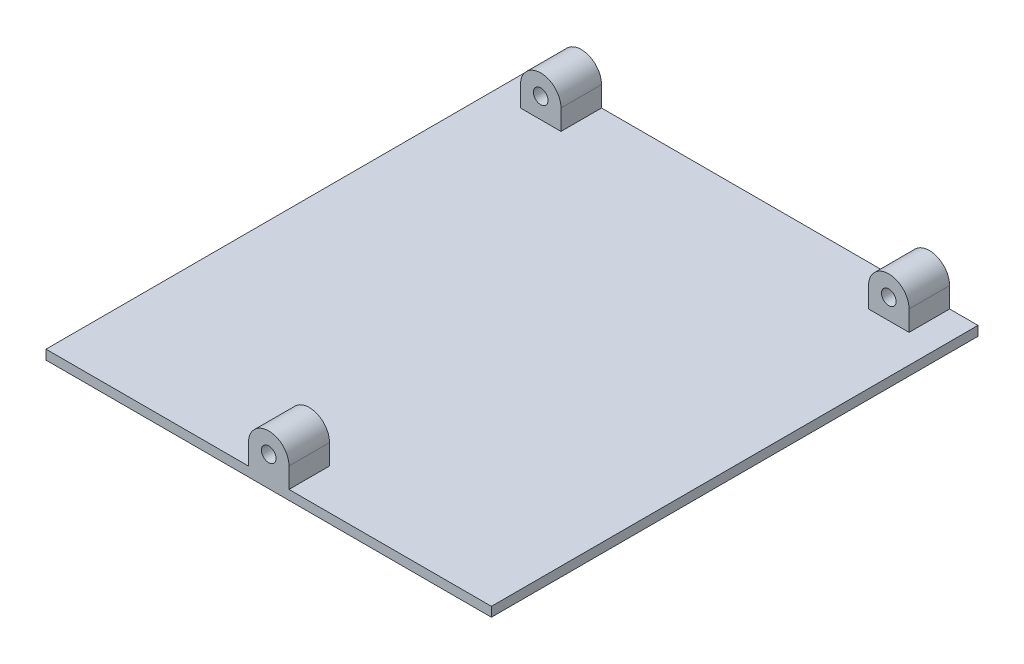
ISO-10303-21;
HEADER;
FILE_DESCRIPTION(('STEP AP214'),'2;1');
FILE_NAME('part.step','',(''),(''),'','','');
FILE_SCHEMA(('AUTOMOTIVE_DESIGN { 1 0 10303 214 1 1 1 1 }'));
ENDSEC;
DATA;
#1=APPLICATION_CONTEXT('core data for automotive mechanical design processes');
#2=APPLICATION_PROTOCOL_DEFINITION('international standard','automotive_design',2000,#1);
#3=PRODUCT_CONTEXT('',#1,'mechanical');
#4=PRODUCT('Part','Part','',(#3));
#5=PRODUCT_RELATED_PRODUCT_CATEGORY('part','',(#4));
#6=PRODUCT_DEFINITION_FORMATION('','',#4);
#7=PRODUCT_DEFINITION_CONTEXT('part definition',#1,'design');
#8=PRODUCT_DEFINITION('design','',#6,#7);
#9=PRODUCT_DEFINITION_SHAPE('','',#8);
#10=(LENGTH_UNIT() NAMED_UNIT(*) SI_UNIT(.MILLI.,.METRE.));
#11=(NAMED_UNIT(*) PLANE_ANGLE_UNIT() SI_UNIT($,.RADIAN.));
#12=(NAMED_UNIT(*) SI_UNIT($,.STERADIAN.) SOLID_ANGLE_UNIT());
#13=UNCERTAINTY_MEASURE_WITH_UNIT(LENGTH_MEASURE(1.E-05),#10,'distance_accuracy_value','');
#14=(GEOMETRIC_REPRESENTATION_CONTEXT(3) GLOBAL_UNCERTAINTY_ASSIGNED_CONTEXT((#13)) GLOBAL_UNIT_ASSIGNED_CONTEXT((#10,
#11,#12)) REPRESENTATION_CONTEXT('',''));
#15=CARTESIAN_POINT('',(0.,0.,0.));
#16=DIRECTION('',(0.,0.,1.));
#17=DIRECTION('',(1.,0.,0.));
#18=AXIS2_PLACEMENT_3D('',#15,#16,#17);
#19=CARTESIAN_POINT('',(0.,6.35,0.));
#20=DIRECTION('',(1.,0.,0.));
#21=DIRECTION('',(0.,0.,-1.));
#22=AXIS2_PLACEMENT_3D('',#19,#20,#21);
#23=PLANE('',#22);
#24=DIRECTION('',(0.,0.,1.));
#25=VECTOR('',#24,1.);
#26=CARTESIAN_POINT('',(0.,2.975,-152.4));
#27=LINE('',#26,#25);
#28=CARTESIAN_POINT('',(0.,2.975,-152.4));
#29=VERTEX_POINT('',#28);
#30=CARTESIAN_POINT('',(0.,2.975,0.));
#31=VERTEX_POINT('',#30);
#32=EDGE_CURVE('E252',#29,#31,#27,.T.);
#33=ORIENTED_EDGE('',*,*,#32,.F.);
#34=DIRECTION('',(0.,-1.,0.));
#35=VECTOR('',#34,1.);
#36=CARTESIAN_POINT('',(0.,6.35,-152.4));
#37=LINE('',#36,#35);
#38=CARTESIAN_POINT('',(0.,0.,-152.4));
#39=VERTEX_POINT('',#38);
#40=EDGE_CURVE('E282',#29,#39,#37,.T.);
#41=ORIENTED_EDGE('',*,*,#40,.T.);
#42=DIRECTION('',(0.,0.,1.));
#43=VECTOR('',#42,1.);
#44=CARTESIAN_POINT('',(0.,0.,0.));
#45=LINE('',#44,#43);
#46=CARTESIAN_POINT('',(0.,0.,0.));
#47=VERTEX_POINT('',#46);
#48=EDGE_CURVE('E269',#39,#47,#45,.T.);
#49=ORIENTED_EDGE('',*,*,#48,.T.);
#50=DIRECTION('',(0.,-1.,0.));
#51=VECTOR('',#50,1.);
#52=CARTESIAN_POINT('',(0.,6.35,0.));
#53=LINE('',#52,#51);
#54=EDGE_CURVE('E11',#31,#47,#53,.T.);
#55=ORIENTED_EDGE('',*,*,#54,.F.);
#56=EDGE_LOOP('',(#33,#41,#49,#55));
#57=FACE_BOUND('',#56,.T.);
#58=ADVANCED_FACE('F37',(#57),#23,.F.);
#59=CARTESIAN_POINT('',(0.,6.35,0.));
#60=DIRECTION('',(0.,0.,-1.));
#61=DIRECTION('',(-1.,0.,0.));
#62=AXIS2_PLACEMENT_3D('',#59,#60,#61);
#63=PLANE('',#62);
#64=DIRECTION('',(1.,0.,0.));
#65=VECTOR('',#64,1.);
#66=CARTESIAN_POINT('',(0.,2.975,0.));
#67=LINE('',#66,#65);
#68=CARTESIAN_POINT('',(63.4,2.975,0.));
#69=VERTEX_POINT('',#68);
#70=EDGE_CURVE('E261',#31,#69,#67,.T.);
#71=ORIENTED_EDGE('',*,*,#70,.F.);
#72=ORIENTED_EDGE('',*,*,#54,.T.);
#73=DIRECTION('',(1.,0.,0.));
#74=VECTOR('',#73,1.);
#75=CARTESIAN_POINT('',(0.,0.,0.));
#76=LINE('',#75,#74);
#77=CARTESIAN_POINT('',(139.5,0.,0.));
#78=VERTEX_POINT('',#77);
#79=EDGE_CURVE('E273',#47,#78,#76,.T.);
#80=ORIENTED_EDGE('',*,*,#79,.T.);
#81=DIRECTION('',(0.,-1.,0.));
#82=VECTOR('',#81,1.);
#83=CARTESIAN_POINT('',(139.5,6.35,0.));
#84=LINE('',#83,#82);
#85=CARTESIAN_POINT('',(139.5,2.975,0.));
#86=VERTEX_POINT('',#85);
#87=EDGE_CURVE('E44',#86,#78,#84,.T.);
#88=ORIENTED_EDGE('',*,*,#87,.F.);
#89=CARTESIAN_POINT('',(76.1,2.975,0.));
#90=VERTEX_POINT('',#89);
#91=EDGE_CURVE('E260',#90,#86,#67,.T.);
#92=ORIENTED_EDGE('',*,*,#91,.F.);
#93=DIRECTION('',(0.,1.,0.));
#94=VECTOR('',#93,1.);
#95=CARTESIAN_POINT('',(76.1,9.32500015835304,0.));
#96=LINE('',#95,#94);
#97=CARTESIAN_POINT('',(76.1,9.32500015835304,0.));
#98=VERTEX_POINT('',#97);
#99=EDGE_CURVE('E233',#90,#98,#96,.T.);
#100=ORIENTED_EDGE('',*,*,#99,.T.);
#101=CARTESIAN_POINT('',(69.75,9.32500015835304,0.));
#102=DIRECTION('',(0.,0.,1.));
#103=DIRECTION('',(1.,0.,0.));
#104=AXIS2_PLACEMENT_3D('',#101,#102,#103);
#105=CIRCLE('',#104,6.35);
#106=CARTESIAN_POINT('',(63.4,9.325,0.));
#107=VERTEX_POINT('',#106);
#108=EDGE_CURVE('E226',#98,#107,#105,.T.);
#109=ORIENTED_EDGE('',*,*,#108,.T.);
#110=DIRECTION('',(0.,-1.,0.));
#111=VECTOR('',#110,1.);
#112=CARTESIAN_POINT('',(63.4,9.325,0.));
#113=LINE('',#112,#111);
#114=EDGE_CURVE('E245',#107,#69,#113,.T.);
#115=ORIENTED_EDGE('',*,*,#114,.T.);
#116=EDGE_LOOP('',(#71,#72,#80,#88,#92,#100,#109,#115));
#117=FACE_BOUND('',#116,.T.);
#118=CARTESIAN_POINT('',(69.75,9.32500015835304,0.));
#119=DIRECTION('',(0.,0.,1.));
#120=DIRECTION('',(1.,0.,0.));
#121=AXIS2_PLACEMENT_3D('',#118,#119,#120);
#122=CIRCLE('',#121,2.28599999999999);
#123=CARTESIAN_POINT('',(72.036,9.32500015835304,0.));
#124=VERTEX_POINT('',#123);
#125=EDGE_CURVE('E215',#124,#124,#122,.T.);
#126=ORIENTED_EDGE('',*,*,#125,.F.);
#127=EDGE_LOOP('',(#126));
#128=FACE_BOUND('',#127,.T.);
#129=ADVANCED_FACE('F296',(#117,#128),#63,.F.);
#130=CARTESIAN_POINT('',(139.5,6.35,0.));
#131=DIRECTION('',(-1.,0.,0.));
#132=DIRECTION('',(0.,0.,1.));
#133=AXIS2_PLACEMENT_3D('',#130,#131,#132);
#134=PLANE('',#133);
#135=DIRECTION('',(0.,0.,-1.));
#136=VECTOR('',#135,1.);
#137=CARTESIAN_POINT('',(139.5,2.975,-152.4));
#138=LINE('',#137,#136);
#139=CARTESIAN_POINT('',(139.5,2.975,-152.4));
#140=VERTEX_POINT('',#139);
#141=EDGE_CURVE('E264',#86,#140,#138,.T.);
#142=ORIENTED_EDGE('',*,*,#141,.F.);
#143=ORIENTED_EDGE('',*,*,#87,.T.);
#144=DIRECTION('',(0.,0.,-1.));
#145=VECTOR('',#144,1.);
#146=CARTESIAN_POINT('',(139.5,0.,0.));
#147=LINE('',#146,#145);
#148=CARTESIAN_POINT('',(139.5,0.,-152.4));
#149=VERTEX_POINT('',#148);
#150=EDGE_CURVE('E276',#78,#149,#147,.T.);
#151=ORIENTED_EDGE('',*,*,#150,.T.);
#152=DIRECTION('',(0.,-1.,0.));
#153=VECTOR('',#152,1.);
#154=CARTESIAN_POINT('',(139.5,6.35,-152.4));
#155=LINE('',#154,#153);
#156=EDGE_CURVE('E284',#140,#149,#155,.T.);
#157=ORIENTED_EDGE('',*,*,#156,.F.);
#158=EDGE_LOOP('',(#142,#143,#151,#157));
#159=FACE_BOUND('',#158,.T.);
#160=ADVANCED_FACE('F288',(#159),#134,.F.);
#161=CARTESIAN_POINT('',(0.,6.35,-152.4));
#162=DIRECTION('',(0.,0.,1.));
#163=DIRECTION('',(1.,0.,0.));
#164=AXIS2_PLACEMENT_3D('',#161,#162,#163);
#165=PLANE('',#164);
#166=DIRECTION('',(-1.,0.,0.));
#167=VECTOR('',#166,1.);
#168=CARTESIAN_POINT('',(0.,2.975,-152.4));
#169=LINE('',#168,#167);
#170=CARTESIAN_POINT('',(130.61,2.975,-152.4));
#171=VERTEX_POINT('',#170);
#172=EDGE_CURVE('E267',#140,#171,#169,.T.);
#173=ORIENTED_EDGE('',*,*,#172,.F.);
#174=ORIENTED_EDGE('',*,*,#156,.T.);
#175=DIRECTION('',(-1.,0.,0.));
#176=VECTOR('',#175,1.);
#177=CARTESIAN_POINT('',(0.,0.,-152.4));
#178=LINE('',#177,#176);
#179=EDGE_CURVE('E279',#149,#39,#178,.T.);
#180=ORIENTED_EDGE('',*,*,#179,.T.);
#181=ORIENTED_EDGE('',*,*,#40,.F.);
#182=CARTESIAN_POINT('',(8.89,2.975,-152.4));
#183=VERTEX_POINT('',#182);
#184=EDGE_CURVE('E266',#183,#29,#169,.T.);
#185=ORIENTED_EDGE('',*,*,#184,.F.);
#186=DIRECTION('',(0.,1.,0.));
#187=VECTOR('',#186,1.);
#188=CARTESIAN_POINT('',(8.89,9.325,-152.4));
#189=LINE('',#188,#187);
#190=CARTESIAN_POINT('',(8.89,9.325,-152.4));
#191=VERTEX_POINT('',#190);
#192=EDGE_CURVE('E168',#183,#191,#189,.T.);
#193=ORIENTED_EDGE('',*,*,#192,.T.);
#194=CARTESIAN_POINT('',(15.24,9.325,-152.4));
#195=DIRECTION('',(0.,0.,-1.));
#196=DIRECTION('',(-1.,0.,0.));
#197=AXIS2_PLACEMENT_3D('',#194,#195,#196);
#198=CIRCLE('',#197,6.35);
#199=CARTESIAN_POINT('',(21.59,9.325,-152.4));
#200=VERTEX_POINT('',#199);
#201=EDGE_CURVE('E178',#191,#200,#198,.T.);
#202=ORIENTED_EDGE('',*,*,#201,.T.);
#203=DIRECTION('',(0.,-1.,0.));
#204=VECTOR('',#203,1.);
#205=CARTESIAN_POINT('',(21.59,9.325,-152.4));
#206=LINE('',#205,#204);
#207=CARTESIAN_POINT('',(21.59,2.975,-152.4));
#208=VERTEX_POINT('',#207);
#209=EDGE_CURVE('E152',#200,#208,#206,.T.);
#210=ORIENTED_EDGE('',*,*,#209,.T.);
#211=CARTESIAN_POINT('',(117.91,2.975,-152.4));
#212=VERTEX_POINT('',#211);
#213=EDGE_CURVE('E270',#212,#208,#169,.T.);
#214=ORIENTED_EDGE('',*,*,#213,.F.);
#215=DIRECTION('',(0.,1.,0.));
#216=VECTOR('',#215,1.);
#217=CARTESIAN_POINT('',(117.91,9.325,-152.4));
#218=LINE('',#217,#216);
#219=CARTESIAN_POINT('',(117.91,9.325,-152.4));
#220=VERTEX_POINT('',#219);
#221=EDGE_CURVE('E197',#212,#220,#218,.T.);
#222=ORIENTED_EDGE('',*,*,#221,.T.);
#223=CARTESIAN_POINT('',(124.26,9.325,-152.4));
#224=DIRECTION('',(0.,0.,-1.));
#225=DIRECTION('',(-1.,0.,0.));
#226=AXIS2_PLACEMENT_3D('',#223,#224,#225);
#227=CIRCLE('',#226,6.35);
#228=CARTESIAN_POINT('',(130.61,9.325,-152.4));
#229=VERTEX_POINT('',#228);
#230=EDGE_CURVE('E190',#220,#229,#227,.T.);
#231=ORIENTED_EDGE('',*,*,#230,.T.);
#232=DIRECTION('',(0.,-1.,0.));
#233=VECTOR('',#232,1.);
#234=CARTESIAN_POINT('',(130.61,9.325,-152.4));
#235=LINE('',#234,#233);
#236=EDGE_CURVE('E208',#229,#171,#235,.T.);
#237=ORIENTED_EDGE('',*,*,#236,.T.);
#238=EDGE_LOOP('',(#173,#174,#180,#181,#185,#193,#202,#210,#214,#222,#231,#237));
#239=FACE_BOUND('',#238,.T.);
#240=CARTESIAN_POINT('',(124.26,9.325,-152.4));
#241=DIRECTION('',(0.,0.,-1.));
#242=DIRECTION('',(-1.,0.,0.));
#243=AXIS2_PLACEMENT_3D('',#240,#241,#242);
#244=CIRCLE('',#243,2.28599999999999);
#245=CARTESIAN_POINT('',(121.974,9.325,-152.4));
#246=VERTEX_POINT('',#245);
#247=EDGE_CURVE('E183',#246,#246,#244,.T.);
#248=ORIENTED_EDGE('',*,*,#247,.F.);
#249=EDGE_LOOP('',(#248));
#250=FACE_BOUND('',#249,.T.);
#251=CARTESIAN_POINT('',(15.24,9.325,-152.4));
#252=DIRECTION('',(0.,0.,-1.));
#253=DIRECTION('',(-1.,0.,0.));
#254=AXIS2_PLACEMENT_3D('',#251,#252,#253);
#255=CIRCLE('',#254,2.286);
#256=CARTESIAN_POINT('',(12.954,9.325,-152.4));
#257=VERTEX_POINT('',#256);
#258=EDGE_CURVE('E173',#257,#257,#255,.T.);
#259=ORIENTED_EDGE('',*,*,#258,.F.);
#260=EDGE_LOOP('',(#259));
#261=FACE_BOUND('',#260,.T.);
#262=ADVANCED_FACE('F305',(#239,#250,#261),#165,.F.);
#263=CARTESIAN_POINT('',(0.,0.,0.));
#264=DIRECTION('',(0.,-1.,0.));
#265=DIRECTION('',(0.,0.,-1.));
#266=AXIS2_PLACEMENT_3D('',#263,#264,#265);
#267=PLANE('',#266);
#268=ORIENTED_EDGE('',*,*,#48,.F.);
#269=ORIENTED_EDGE('',*,*,#179,.F.);
#270=ORIENTED_EDGE('',*,*,#150,.F.);
#271=ORIENTED_EDGE('',*,*,#79,.F.);
#272=EDGE_LOOP('',(#268,#269,#270,#271));
#273=FACE_BOUND('',#272,.T.);
#274=ADVANCED_FACE('F301',(#273),#267,.T.);
#275=CARTESIAN_POINT('',(0.,2.975,0.));
#276=DIRECTION('',(0.,1.,0.));
#277=DIRECTION('',(0.,0.,1.));
#278=AXIS2_PLACEMENT_3D('',#275,#276,#277);
#279=PLANE('',#278);
#280=DIRECTION('',(0.,0.,-1.));
#281=VECTOR('',#280,1.);
#282=CARTESIAN_POINT('',(8.89,2.975,-139.7));
#283=LINE('',#282,#281);
#284=CARTESIAN_POINT('',(8.89,2.975,-139.7));
#285=VERTEX_POINT('',#284);
#286=EDGE_CURVE('E184',#285,#183,#283,.T.);
#287=ORIENTED_EDGE('',*,*,#286,.T.);
#288=ORIENTED_EDGE('',*,*,#184,.T.);
#289=ORIENTED_EDGE('',*,*,#32,.T.);
#290=ORIENTED_EDGE('',*,*,#70,.T.);
#291=DIRECTION('',(0.,0.,1.));
#292=VECTOR('',#291,1.);
#293=CARTESIAN_POINT('',(63.4,2.975,-12.7));
#294=LINE('',#293,#292);
#295=CARTESIAN_POINT('',(63.4,2.975,-12.7));
#296=VERTEX_POINT('',#295);
#297=EDGE_CURVE('E256',#296,#69,#294,.T.);
#298=ORIENTED_EDGE('',*,*,#297,.F.);
#299=DIRECTION('',(1.,0.,0.));
#300=VECTOR('',#299,1.);
#301=CARTESIAN_POINT('',(63.4,2.975,-12.7));
#302=LINE('',#301,#300);
#303=CARTESIAN_POINT('',(76.1,2.97500000000001,-12.7));
#304=VERTEX_POINT('',#303);
#305=EDGE_CURVE('E236',#296,#304,#302,.T.);
#306=ORIENTED_EDGE('',*,*,#305,.T.);
#307=DIRECTION('',(0.,0.,1.));
#308=VECTOR('',#307,1.);
#309=CARTESIAN_POINT('',(76.1,2.97500000000001,-12.7));
#310=LINE('',#309,#308);
#311=EDGE_CURVE('E253',#304,#90,#310,.T.);
#312=ORIENTED_EDGE('',*,*,#311,.T.);
#313=ORIENTED_EDGE('',*,*,#91,.T.);
#314=ORIENTED_EDGE('',*,*,#141,.T.);
#315=ORIENTED_EDGE('',*,*,#172,.T.);
#316=DIRECTION('',(0.,0.,-1.));
#317=VECTOR('',#316,1.);
#318=CARTESIAN_POINT('',(130.61,2.975,-139.7));
#319=LINE('',#318,#317);
#320=CARTESIAN_POINT('',(130.61,2.975,-139.7));
#321=VERTEX_POINT('',#320);
#322=EDGE_CURVE('E219',#321,#171,#319,.T.);
#323=ORIENTED_EDGE('',*,*,#322,.F.);
#324=DIRECTION('',(-1.,0.,0.));
#325=VECTOR('',#324,1.);
#326=CARTESIAN_POINT('',(130.61,2.975,-139.7));
#327=LINE('',#326,#325);
#328=CARTESIAN_POINT('',(117.91,2.975,-139.7));
#329=VERTEX_POINT('',#328);
#330=EDGE_CURVE('E200',#321,#329,#327,.T.);
#331=ORIENTED_EDGE('',*,*,#330,.T.);
#332=DIRECTION('',(0.,0.,-1.));
#333=VECTOR('',#332,1.);
#334=CARTESIAN_POINT('',(117.91,2.975,-139.7));
#335=LINE('',#334,#333);
#336=EDGE_CURVE('E216',#329,#212,#335,.T.);
#337=ORIENTED_EDGE('',*,*,#336,.T.);
#338=ORIENTED_EDGE('',*,*,#213,.T.);
#339=DIRECTION('',(0.,0.,-1.));
#340=VECTOR('',#339,1.);
#341=CARTESIAN_POINT('',(21.59,2.975,-139.7));
#342=LINE('',#341,#340);
#343=CARTESIAN_POINT('',(21.59,2.975,-139.7));
#344=VERTEX_POINT('',#343);
#345=EDGE_CURVE('E56',#344,#208,#342,.T.);
#346=ORIENTED_EDGE('',*,*,#345,.F.);
#347=DIRECTION('',(-1.,0.,0.));
#348=VECTOR('',#347,1.);
#349=CARTESIAN_POINT('',(21.59,2.975,-139.7));
#350=LINE('',#349,#348);
#351=EDGE_CURVE('E51',#344,#285,#350,.T.);
#352=ORIENTED_EDGE('',*,*,#351,.T.);
#353=EDGE_LOOP('',(#287,#288,#289,#290,#298,#306,#312,#313,#314,#315,#323,#331,#337,#338,#346,#352));
#354=FACE_BOUND('',#353,.T.);
#355=ADVANCED_FACE('F308',(#354),#279,.T.);
#356=CARTESIAN_POINT('',(69.75,9.32500015835304,-12.7));
#357=DIRECTION('',(0.,0.,1.));
#358=DIRECTION('',(1.,0.,0.));
#359=AXIS2_PLACEMENT_3D('',#356,#357,#358);
#360=CYLINDRICAL_SURFACE('',#359,6.35);
#361=ORIENTED_EDGE('',*,*,#108,.F.);
#362=DIRECTION('',(0.,0.,1.));
#363=VECTOR('',#362,1.);
#364=CARTESIAN_POINT('',(76.1,9.32500015835304,-12.7));
#365=LINE('',#364,#363);
#366=CARTESIAN_POINT('',(76.1,9.32500015835304,-12.7));
#367=VERTEX_POINT('',#366);
#368=EDGE_CURVE('E250',#367,#98,#365,.T.);
#369=ORIENTED_EDGE('',*,*,#368,.F.);
#370=CARTESIAN_POINT('',(69.75,9.32500015835304,-12.7));
#371=DIRECTION('',(0.,0.,1.));
#372=DIRECTION('',(1.,0.,0.));
#373=AXIS2_PLACEMENT_3D('',#370,#371,#372);
#374=CIRCLE('',#373,6.35);
#375=CARTESIAN_POINT('',(63.4,9.325,-12.7));
#376=VERTEX_POINT('',#375);
#377=EDGE_CURVE('E229',#367,#376,#374,.T.);
#378=ORIENTED_EDGE('',*,*,#377,.T.);
#379=DIRECTION('',(0.,0.,1.));
#380=VECTOR('',#379,1.);
#381=CARTESIAN_POINT('',(63.4,9.325,-12.7));
#382=LINE('',#381,#380);
#383=EDGE_CURVE('E242',#376,#107,#382,.T.);
#384=ORIENTED_EDGE('',*,*,#383,.T.);
#385=EDGE_LOOP('',(#361,#369,#378,#384));
#386=FACE_BOUND('',#385,.T.);
#387=ADVANCED_FACE('F344',(#386),#360,.T.);
#388=CARTESIAN_POINT('',(76.1,9.32500015835304,-12.7));
#389=DIRECTION('',(1.,0.,0.));
#390=DIRECTION('',(0.,0.,-1.));
#391=AXIS2_PLACEMENT_3D('',#388,#389,#390);
#392=PLANE('',#391);
#393=ORIENTED_EDGE('',*,*,#99,.F.);
#394=ORIENTED_EDGE('',*,*,#311,.F.);
#395=DIRECTION('',(0.,1.,0.));
#396=VECTOR('',#395,1.);
#397=CARTESIAN_POINT('',(76.1,9.32500015835304,-12.7));
#398=LINE('',#397,#396);
#399=EDGE_CURVE('E239',#304,#367,#398,.T.);
#400=ORIENTED_EDGE('',*,*,#399,.T.);
#401=ORIENTED_EDGE('',*,*,#368,.T.);
#402=EDGE_LOOP('',(#393,#394,#400,#401));
#403=FACE_BOUND('',#402,.T.);
#404=ADVANCED_FACE('F347',(#403),#392,.T.);
#405=CARTESIAN_POINT('',(63.4,9.325,-12.7));
#406=DIRECTION('',(-1.,0.,0.));
#407=DIRECTION('',(0.,0.,1.));
#408=AXIS2_PLACEMENT_3D('',#405,#406,#407);
#409=PLANE('',#408);
#410=ORIENTED_EDGE('',*,*,#114,.F.);
#411=ORIENTED_EDGE('',*,*,#383,.F.);
#412=DIRECTION('',(0.,-1.,0.));
#413=VECTOR('',#412,1.);
#414=CARTESIAN_POINT('',(63.4,9.325,-12.7));
#415=LINE('',#414,#413);
#416=EDGE_CURVE('E232',#376,#296,#415,.T.);
#417=ORIENTED_EDGE('',*,*,#416,.T.);
#418=ORIENTED_EDGE('',*,*,#297,.T.);
#419=EDGE_LOOP('',(#410,#411,#417,#418));
#420=FACE_BOUND('',#419,.T.);
#421=ADVANCED_FACE('F349',(#420),#409,.T.);
#422=CARTESIAN_POINT('',(69.75,9.32500015835304,-12.7));
#423=DIRECTION('',(0.,0.,1.));
#424=DIRECTION('',(1.,0.,0.));
#425=AXIS2_PLACEMENT_3D('',#422,#423,#424);
#426=PLANE('',#425);
#427=CARTESIAN_POINT('',(69.75,9.32500015835304,-12.7));
#428=DIRECTION('',(0.,0.,1.));
#429=DIRECTION('',(1.,0.,0.));
#430=AXIS2_PLACEMENT_3D('',#427,#428,#429);
#431=CIRCLE('',#430,2.28599999999999);
#432=CARTESIAN_POINT('',(72.036,9.32500015835304,-12.7));
#433=VERTEX_POINT('',#432);
#434=EDGE_CURVE('E223',#433,#433,#431,.T.);
#435=ORIENTED_EDGE('',*,*,#434,.T.);
#436=EDGE_LOOP('',(#435));
#437=FACE_BOUND('',#436,.T.);
#438=ORIENTED_EDGE('',*,*,#377,.F.);
#439=ORIENTED_EDGE('',*,*,#399,.F.);
#440=ORIENTED_EDGE('',*,*,#305,.F.);
#441=ORIENTED_EDGE('',*,*,#416,.F.);
#442=EDGE_LOOP('',(#438,#439,#440,#441));
#443=FACE_BOUND('',#442,.T.);
#444=ADVANCED_FACE('F352',(#437,#443),#426,.F.);
#445=CARTESIAN_POINT('',(69.75,9.32500015835304,-12.7));
#446=DIRECTION('',(0.,0.,1.));
#447=DIRECTION('',(1.,0.,0.));
#448=AXIS2_PLACEMENT_3D('',#445,#446,#447);
#449=CYLINDRICAL_SURFACE('',#448,2.28599999999999);
#450=ORIENTED_EDGE('',*,*,#434,.F.);
#451=EDGE_LOOP('',(#450));
#452=FACE_BOUND('',#451,.T.);
#453=ORIENTED_EDGE('',*,*,#125,.T.);
#454=EDGE_LOOP('',(#453));
#455=FACE_BOUND('',#454,.T.);
#456=ADVANCED_FACE('F359',(#452,#455),#449,.F.);
#457=CARTESIAN_POINT('',(124.26,9.325,-139.7));
#458=DIRECTION('',(0.,0.,-1.));
#459=DIRECTION('',(-1.,0.,0.));
#460=AXIS2_PLACEMENT_3D('',#457,#458,#459);
#461=CYLINDRICAL_SURFACE('',#460,6.35);
#462=ORIENTED_EDGE('',*,*,#230,.F.);
#463=DIRECTION('',(0.,0.,-1.));
#464=VECTOR('',#463,1.);
#465=CARTESIAN_POINT('',(117.91,9.325,-139.7));
#466=LINE('',#465,#464);
#467=CARTESIAN_POINT('',(117.91,9.325,-139.7));
#468=VERTEX_POINT('',#467);
#469=EDGE_CURVE('E213',#468,#220,#466,.T.);
#470=ORIENTED_EDGE('',*,*,#469,.F.);
#471=CARTESIAN_POINT('',(124.26,9.325,-139.7));
#472=DIRECTION('',(0.,0.,-1.));
#473=DIRECTION('',(-1.,0.,0.));
#474=AXIS2_PLACEMENT_3D('',#471,#472,#473);
#475=CIRCLE('',#474,6.35);
#476=CARTESIAN_POINT('',(130.61,9.325,-139.7));
#477=VERTEX_POINT('',#476);
#478=EDGE_CURVE('E193',#468,#477,#475,.T.);
#479=ORIENTED_EDGE('',*,*,#478,.T.);
#480=DIRECTION('',(0.,0.,-1.));
#481=VECTOR('',#480,1.);
#482=CARTESIAN_POINT('',(130.61,9.325,-139.7));
#483=LINE('',#482,#481);
#484=EDGE_CURVE('E205',#477,#229,#483,.T.);
#485=ORIENTED_EDGE('',*,*,#484,.T.);
#486=EDGE_LOOP('',(#462,#470,#479,#485));
#487=FACE_BOUND('',#486,.T.);
#488=ADVANCED_FACE('F319',(#487),#461,.T.);
#489=CARTESIAN_POINT('',(117.91,9.325,-139.7));
#490=DIRECTION('',(-1.,0.,0.));
#491=DIRECTION('',(0.,0.,1.));
#492=AXIS2_PLACEMENT_3D('',#489,#490,#491);
#493=PLANE('',#492);
#494=ORIENTED_EDGE('',*,*,#221,.F.);
#495=ORIENTED_EDGE('',*,*,#336,.F.);
#496=DIRECTION('',(0.,1.,0.));
#497=VECTOR('',#496,1.);
#498=CARTESIAN_POINT('',(117.91,9.325,-139.7));
#499=LINE('',#498,#497);
#500=EDGE_CURVE('E202',#329,#468,#499,.T.);
#501=ORIENTED_EDGE('',*,*,#500,.T.);
#502=ORIENTED_EDGE('',*,*,#469,.T.);
#503=EDGE_LOOP('',(#494,#495,#501,#502));
#504=FACE_BOUND('',#503,.T.);
#505=ADVANCED_FACE('F322',(#504),#493,.T.);
#506=CARTESIAN_POINT('',(130.61,9.325,-139.7));
#507=DIRECTION('',(1.,0.,0.));
#508=DIRECTION('',(0.,0.,-1.));
#509=AXIS2_PLACEMENT_3D('',#506,#507,#508);
#510=PLANE('',#509);
#511=ORIENTED_EDGE('',*,*,#236,.F.);
#512=ORIENTED_EDGE('',*,*,#484,.F.);
#513=DIRECTION('',(0.,-1.,0.));
#514=VECTOR('',#513,1.);
#515=CARTESIAN_POINT('',(130.61,9.325,-139.7));
#516=LINE('',#515,#514);
#517=EDGE_CURVE('E196',#477,#321,#516,.T.);
#518=ORIENTED_EDGE('',*,*,#517,.T.);
#519=ORIENTED_EDGE('',*,*,#322,.T.);
#520=EDGE_LOOP('',(#511,#512,#518,#519));
#521=FACE_BOUND('',#520,.T.);
#522=ADVANCED_FACE('F311',(#521),#510,.T.);
#523=CARTESIAN_POINT('',(124.26,9.325,-139.7));
#524=DIRECTION('',(0.,0.,-1.));
#525=DIRECTION('',(-1.,0.,0.));
#526=AXIS2_PLACEMENT_3D('',#523,#524,#525);
#527=PLANE('',#526);
#528=CARTESIAN_POINT('',(124.26,9.325,-139.7));
#529=DIRECTION('',(0.,0.,-1.));
#530=DIRECTION('',(-1.,0.,0.));
#531=AXIS2_PLACEMENT_3D('',#528,#529,#530);
#532=CIRCLE('',#531,2.28599999999999);
#533=CARTESIAN_POINT('',(121.974,9.325,-139.7));
#534=VERTEX_POINT('',#533);
#535=EDGE_CURVE('E187',#534,#534,#532,.T.);
#536=ORIENTED_EDGE('',*,*,#535,.T.);
#537=EDGE_LOOP('',(#536));
#538=FACE_BOUND('',#537,.T.);
#539=ORIENTED_EDGE('',*,*,#478,.F.);
#540=ORIENTED_EDGE('',*,*,#500,.F.);
#541=ORIENTED_EDGE('',*,*,#330,.F.);
#542=ORIENTED_EDGE('',*,*,#517,.F.);
#543=EDGE_LOOP('',(#539,#540,#541,#542));
#544=FACE_BOUND('',#543,.T.);
#545=ADVANCED_FACE('F315',(#538,#544),#527,.F.);
#546=CARTESIAN_POINT('',(124.26,9.325,-139.7));
#547=DIRECTION('',(0.,0.,-1.));
#548=DIRECTION('',(-1.,0.,0.));
#549=AXIS2_PLACEMENT_3D('',#546,#547,#548);
#550=CYLINDRICAL_SURFACE('',#549,2.28599999999999);
#551=ORIENTED_EDGE('',*,*,#535,.F.);
#552=EDGE_LOOP('',(#551));
#553=FACE_BOUND('',#552,.T.);
#554=ORIENTED_EDGE('',*,*,#247,.T.);
#555=EDGE_LOOP('',(#554));
#556=FACE_BOUND('',#555,.T.);
#557=ADVANCED_FACE('F372',(#553,#556),#550,.F.);
#558=CARTESIAN_POINT('',(15.24,9.325,-139.7));
#559=DIRECTION('',(0.,0.,-1.));
#560=DIRECTION('',(-1.,0.,0.));
#561=AXIS2_PLACEMENT_3D('',#558,#559,#560);
#562=CYLINDRICAL_SURFACE('',#561,6.35);
#563=ORIENTED_EDGE('',*,*,#201,.F.);
#564=DIRECTION('',(0.,0.,-1.));
#565=VECTOR('',#564,1.);
#566=CARTESIAN_POINT('',(8.89,9.325,-139.7));
#567=LINE('',#566,#565);
#568=CARTESIAN_POINT('',(8.89,9.325,-139.7));
#569=VERTEX_POINT('',#568);
#570=EDGE_CURVE('E167',#569,#191,#567,.T.);
#571=ORIENTED_EDGE('',*,*,#570,.F.);
#572=CARTESIAN_POINT('',(15.24,9.325,-139.7));
#573=DIRECTION('',(0.,0.,-1.));
#574=DIRECTION('',(-1.,0.,0.));
#575=AXIS2_PLACEMENT_3D('',#572,#573,#574);
#576=CIRCLE('',#575,6.35);
#577=CARTESIAN_POINT('',(21.59,9.325,-139.7));
#578=VERTEX_POINT('',#577);
#579=EDGE_CURVE('E163',#569,#578,#576,.T.);
#580=ORIENTED_EDGE('',*,*,#579,.T.);
#581=DIRECTION('',(0.,0.,-1.));
#582=VECTOR('',#581,1.);
#583=CARTESIAN_POINT('',(21.59,9.325,-139.7));
#584=LINE('',#583,#582);
#585=EDGE_CURVE('E147',#578,#200,#584,.T.);
#586=ORIENTED_EDGE('',*,*,#585,.T.);
#587=EDGE_LOOP('',(#563,#571,#580,#586));
#588=FACE_BOUND('',#587,.T.);
#589=ADVANCED_FACE('F166',(#588),#562,.T.);
#590=CARTESIAN_POINT('',(8.89,9.325,-139.7));
#591=DIRECTION('',(-1.,0.,0.));
#592=DIRECTION('',(0.,-1.,0.));
#593=AXIS2_PLACEMENT_3D('',#590,#591,#592);
#594=PLANE('',#593);
#595=ORIENTED_EDGE('',*,*,#192,.F.);
#596=ORIENTED_EDGE('',*,*,#286,.F.);
#597=DIRECTION('',(0.,1.,0.));
#598=VECTOR('',#597,1.);
#599=CARTESIAN_POINT('',(8.89,9.325,-139.7));
#600=LINE('',#599,#598);
#601=EDGE_CURVE('E157',#285,#569,#600,.T.);
#602=ORIENTED_EDGE('',*,*,#601,.T.);
#603=ORIENTED_EDGE('',*,*,#570,.T.);
#604=EDGE_LOOP('',(#595,#596,#602,#603));
#605=FACE_BOUND('',#604,.T.);
#606=ADVANCED_FACE('F326',(#605),#594,.T.);
#607=CARTESIAN_POINT('',(21.59,9.325,-139.7));
#608=DIRECTION('',(1.,0.,0.));
#609=DIRECTION('',(0.,1.,0.));
#610=AXIS2_PLACEMENT_3D('',#607,#608,#609);
#611=PLANE('',#610);
#612=ORIENTED_EDGE('',*,*,#209,.F.);
#613=ORIENTED_EDGE('',*,*,#585,.F.);
#614=DIRECTION('',(0.,-1.,0.));
#615=VECTOR('',#614,1.);
#616=CARTESIAN_POINT('',(21.59,9.325,-139.7));
#617=LINE('',#616,#615);
#618=EDGE_CURVE('E150',#578,#344,#617,.T.);
#619=ORIENTED_EDGE('',*,*,#618,.T.);
#620=ORIENTED_EDGE('',*,*,#345,.T.);
#621=EDGE_LOOP('',(#612,#613,#619,#620));
#622=FACE_BOUND('',#621,.T.);
#623=ADVANCED_FACE('F149',(#622),#611,.T.);
#624=CARTESIAN_POINT('',(15.24,9.325,-139.7));
#625=DIRECTION('',(0.,0.,-1.));
#626=DIRECTION('',(-1.,0.,0.));
#627=AXIS2_PLACEMENT_3D('',#624,#625,#626);
#628=PLANE('',#627);
#629=CARTESIAN_POINT('',(15.24,9.325,-139.7));
#630=DIRECTION('',(0.,0.,-1.));
#631=DIRECTION('',(-1.,0.,0.));
#632=AXIS2_PLACEMENT_3D('',#629,#630,#631);
#633=CIRCLE('',#632,2.286);
#634=CARTESIAN_POINT('',(12.954,9.325,-139.7));
#635=VERTEX_POINT('',#634);
#636=EDGE_CURVE('E180',#635,#635,#633,.T.);
#637=ORIENTED_EDGE('',*,*,#636,.T.);
#638=EDGE_LOOP('',(#637));
#639=FACE_BOUND('',#638,.T.);
#640=ORIENTED_EDGE('',*,*,#579,.F.);
#641=ORIENTED_EDGE('',*,*,#601,.F.);
#642=ORIENTED_EDGE('',*,*,#351,.F.);
#643=ORIENTED_EDGE('',*,*,#618,.F.);
#644=EDGE_LOOP('',(#640,#641,#642,#643));
#645=FACE_BOUND('',#644,.T.);
#646=ADVANCED_FACE('F161',(#639,#645),#628,.F.);
#647=CARTESIAN_POINT('',(15.24,9.325,-139.7));
#648=DIRECTION('',(0.,0.,-1.));
#649=DIRECTION('',(-1.,0.,0.));
#650=AXIS2_PLACEMENT_3D('',#647,#648,#649);
#651=CYLINDRICAL_SURFACE('',#650,2.286);
#652=ORIENTED_EDGE('',*,*,#636,.F.);
#653=EDGE_LOOP('',(#652));
#654=FACE_BOUND('',#653,.T.);
#655=ORIENTED_EDGE('',*,*,#258,.T.);
#656=EDGE_LOOP('',(#655));
#657=FACE_BOUND('',#656,.T.);
#658=ADVANCED_FACE('F385',(#654,#657),#651,.F.);
#659=CLOSED_SHELL('',(#58,#129,#160,#262,#274,#355,#387,#404,#421,#444,#456,#488,#505,#522,#545,
#557,#589,#606,#623,#646,#658));
#660=MANIFOLD_SOLID_BREP('B2',#659);
#661=ADVANCED_BREP_SHAPE_REPRESENTATION('',(#18,#660),#14);
#662=SHAPE_DEFINITION_REPRESENTATION(#9,#661);
ENDSEC;
END-ISO-10303-21;
